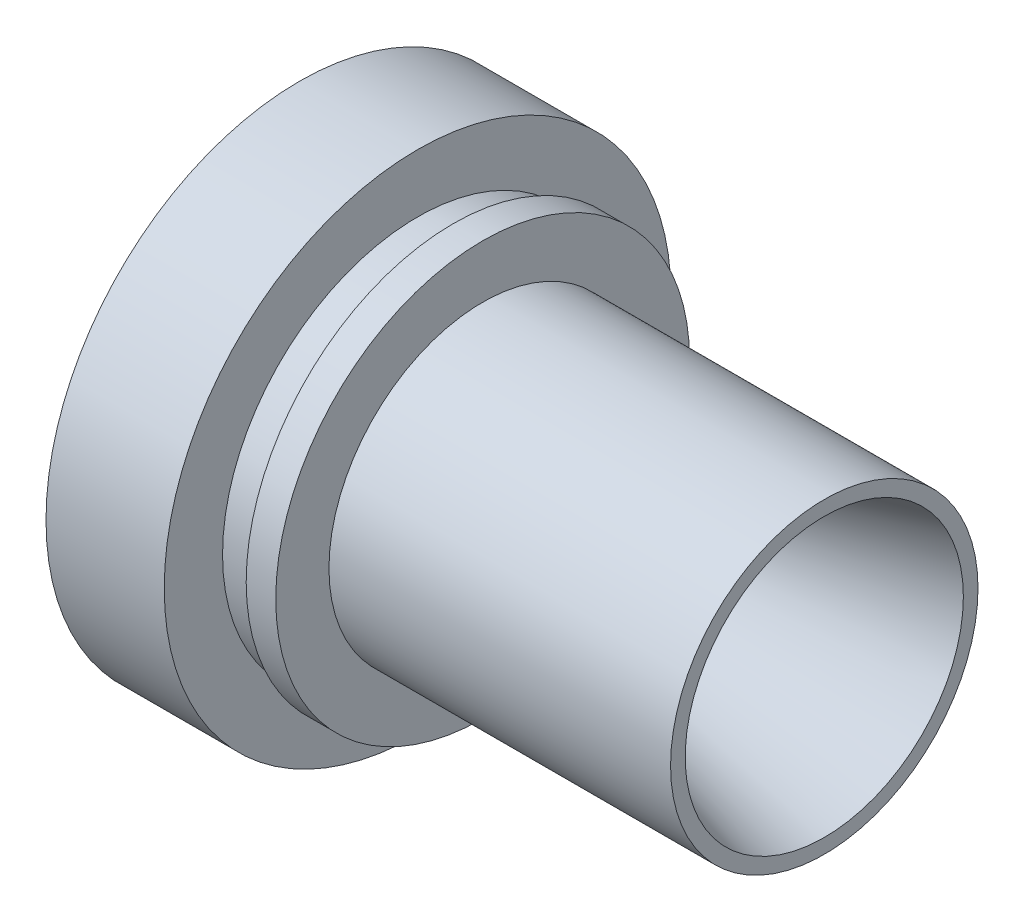
ISO-10303-21;
HEADER;
FILE_DESCRIPTION(('STEP AP214'),'2;1');
FILE_NAME('part.step','',(''),(''),'','','');
FILE_SCHEMA(('AUTOMOTIVE_DESIGN { 1 0 10303 214 1 1 1 1 }'));
ENDSEC;
DATA;
#1=APPLICATION_CONTEXT('core data for automotive mechanical design processes');
#2=APPLICATION_PROTOCOL_DEFINITION('international standard','automotive_design',2000,#1);
#3=PRODUCT_CONTEXT('',#1,'mechanical');
#4=PRODUCT('Part','Part','',(#3));
#5=PRODUCT_RELATED_PRODUCT_CATEGORY('part','',(#4));
#6=PRODUCT_DEFINITION_FORMATION('','',#4);
#7=PRODUCT_DEFINITION_CONTEXT('part definition',#1,'design');
#8=PRODUCT_DEFINITION('design','',#6,#7);
#9=PRODUCT_DEFINITION_SHAPE('','',#8);
#10=(LENGTH_UNIT() NAMED_UNIT(*) SI_UNIT(.MILLI.,.METRE.));
#11=(NAMED_UNIT(*) PLANE_ANGLE_UNIT() SI_UNIT($,.RADIAN.));
#12=(NAMED_UNIT(*) SI_UNIT($,.STERADIAN.) SOLID_ANGLE_UNIT());
#13=UNCERTAINTY_MEASURE_WITH_UNIT(LENGTH_MEASURE(1.E-05),#10,'distance_accuracy_value','');
#14=(GEOMETRIC_REPRESENTATION_CONTEXT(3) GLOBAL_UNCERTAINTY_ASSIGNED_CONTEXT((#13)) GLOBAL_UNIT_ASSIGNED_CONTEXT((#10,
#11,#12)) REPRESENTATION_CONTEXT('',''));
#15=CARTESIAN_POINT('',(0.,0.,0.));
#16=DIRECTION('',(0.,0.,1.));
#17=DIRECTION('',(1.,0.,0.));
#18=AXIS2_PLACEMENT_3D('',#15,#16,#17);
#19=CARTESIAN_POINT('',(18.4932034355967,0.,0.));
#20=DIRECTION('',(1.,0.,0.));
#21=DIRECTION('',(0.,0.,-1.));
#22=AXIS2_PLACEMENT_3D('',#19,#20,#21);
#23=TOROIDAL_SURFACE('',#22,25.58,15.);
#24=CARTESIAN_POINT('',(22.3754891121344,0.,0.));
#25=DIRECTION('',(1.,0.,0.));
#26=DIRECTION('',(0.,0.,-1.));
#27=AXIS2_PLACEMENT_3D('',#24,#25,#26);
#28=CIRCLE('',#27,11.091112605664);
#29=CARTESIAN_POINT('',(22.3754891121344,0.,-11.091112605664));
#30=VERTEX_POINT('',#29);
#31=EDGE_CURVE('E10',#30,#30,#28,.T.);
#32=ORIENTED_EDGE('',*,*,#31,.T.);
#33=EDGE_LOOP('',(#32));
#34=FACE_BOUND('',#33,.T.);
#35=CARTESIAN_POINT('',(7.88660171779858,0.,0.));
#36=DIRECTION('',(1.,0.,0.));
#37=DIRECTION('',(0.,0.,-1.));
#38=AXIS2_PLACEMENT_3D('',#35,#36,#37);
#39=CIRCLE('',#38,14.9733982822017);
#40=CARTESIAN_POINT('',(7.88660171779858,0.,-14.9733982822017));
#41=VERTEX_POINT('',#40);
#42=EDGE_CURVE('E84',#41,#41,#39,.T.);
#43=ORIENTED_EDGE('',*,*,#42,.F.);
#44=EDGE_LOOP('',(#43));
#45=FACE_BOUND('',#44,.T.);
#46=ADVANCED_FACE('F37',(#34,#45),#23,.T.);
#47=CARTESIAN_POINT('',(22.3754891121344,0.,0.));
#48=DIRECTION('',(1.,0.,0.));
#49=DIRECTION('',(0.,0.,-1.));
#50=AXIS2_PLACEMENT_3D('',#47,#48,#49);
#51=CONICAL_SURFACE('',#50,11.091112605664,0.261799387799143);
#52=CARTESIAN_POINT('',(68.779388603388,0.,0.));
#53=DIRECTION('',(1.,0.,0.));
#54=DIRECTION('',(0.,0.,-1.));
#55=AXIS2_PLACEMENT_3D('',#52,#53,#54);
#56=CIRCLE('',#55,23.525);
#57=CARTESIAN_POINT('',(68.779388603388,0.,-23.525));
#58=VERTEX_POINT('',#57);
#59=EDGE_CURVE('E44',#58,#58,#56,.T.);
#60=ORIENTED_EDGE('',*,*,#59,.T.);
#61=EDGE_LOOP('',(#60));
#62=FACE_BOUND('',#61,.T.);
#63=ORIENTED_EDGE('',*,*,#31,.F.);
#64=EDGE_LOOP('',(#63));
#65=FACE_BOUND('',#64,.T.);
#66=ADVANCED_FACE('F93',(#62,#65),#51,.F.);
#67=CARTESIAN_POINT('',(68.779388603388,23.525,0.));
#68=DIRECTION('',(1.,0.,0.));
#69=DIRECTION('',(0.,0.,-1.));
#70=AXIS2_PLACEMENT_3D('',#67,#68,#69);
#71=PLANE('',#70);
#72=CARTESIAN_POINT('',(68.779388603388,0.,0.));
#73=DIRECTION('',(1.,0.,0.));
#74=DIRECTION('',(0.,0.,-1.));
#75=AXIS2_PLACEMENT_3D('',#72,#73,#74);
#76=CIRCLE('',#75,26.);
#77=CARTESIAN_POINT('',(68.779388603388,0.,-26.));
#78=VERTEX_POINT('',#77);
#79=EDGE_CURVE('E49',#78,#78,#76,.T.);
#80=ORIENTED_EDGE('',*,*,#79,.T.);
#81=EDGE_LOOP('',(#80));
#82=FACE_BOUND('',#81,.T.);
#83=ORIENTED_EDGE('',*,*,#59,.F.);
#84=EDGE_LOOP('',(#83));
#85=FACE_BOUND('',#84,.T.);
#86=ADVANCED_FACE('F97',(#82,#85),#71,.T.);
#87=CARTESIAN_POINT('',(0.,0.,0.));
#88=DIRECTION('',(1.,0.,0.));
#89=DIRECTION('',(0.,0.,-1.));
#90=AXIS2_PLACEMENT_3D('',#87,#88,#89);
#91=CYLINDRICAL_SURFACE('',#90,26.);
#92=CARTESIAN_POINT('',(11.,0.,0.));
#93=DIRECTION('',(1.,0.,0.));
#94=DIRECTION('',(0.,0.,-1.));
#95=AXIS2_PLACEMENT_3D('',#92,#93,#94);
#96=CIRCLE('',#95,26.);
#97=CARTESIAN_POINT('',(11.,0.,-26.));
#98=VERTEX_POINT('',#97);
#99=EDGE_CURVE('E54',#98,#98,#96,.T.);
#100=ORIENTED_EDGE('',*,*,#99,.T.);
#101=EDGE_LOOP('',(#100));
#102=FACE_BOUND('',#101,.T.);
#103=ORIENTED_EDGE('',*,*,#79,.F.);
#104=EDGE_LOOP('',(#103));
#105=FACE_BOUND('',#104,.T.);
#106=ADVANCED_FACE('F101',(#102,#105),#91,.T.);
#107=CARTESIAN_POINT('',(11.,26.,0.));
#108=DIRECTION('',(1.,0.,0.));
#109=DIRECTION('',(0.,0.,-1.));
#110=AXIS2_PLACEMENT_3D('',#107,#108,#109);
#111=PLANE('',#110);
#112=CARTESIAN_POINT('',(11.,0.,0.));
#113=DIRECTION('',(1.,0.,0.));
#114=DIRECTION('',(0.,0.,-1.));
#115=AXIS2_PLACEMENT_3D('',#112,#113,#114);
#116=CIRCLE('',#115,35.);
#117=CARTESIAN_POINT('',(11.,0.,-35.));
#118=VERTEX_POINT('',#117);
#119=EDGE_CURVE('E60',#118,#118,#116,.T.);
#120=ORIENTED_EDGE('',*,*,#119,.T.);
#121=EDGE_LOOP('',(#120));
#122=FACE_BOUND('',#121,.T.);
#123=ORIENTED_EDGE('',*,*,#99,.F.);
#124=EDGE_LOOP('',(#123));
#125=FACE_BOUND('',#124,.T.);
#126=ADVANCED_FACE('F108',(#122,#125),#111,.T.);
#127=CARTESIAN_POINT('',(0.,0.,0.));
#128=DIRECTION('',(1.,0.,0.));
#129=DIRECTION('',(0.,0.,-1.));
#130=AXIS2_PLACEMENT_3D('',#127,#128,#129);
#131=CYLINDRICAL_SURFACE('',#130,35.);
#132=CARTESIAN_POINT('',(6.,0.,0.));
#133=DIRECTION('',(1.,0.,0.));
#134=DIRECTION('',(0.,0.,-1.));
#135=AXIS2_PLACEMENT_3D('',#132,#133,#134);
#136=CIRCLE('',#135,35.);
#137=CARTESIAN_POINT('',(6.,0.,-35.));
#138=VERTEX_POINT('',#137);
#139=EDGE_CURVE('E64',#138,#138,#136,.T.);
#140=ORIENTED_EDGE('',*,*,#139,.T.);
#141=EDGE_LOOP('',(#140));
#142=FACE_BOUND('',#141,.T.);
#143=ORIENTED_EDGE('',*,*,#119,.F.);
#144=EDGE_LOOP('',(#143));
#145=FACE_BOUND('',#144,.T.);
#146=ADVANCED_FACE('F112',(#142,#145),#131,.T.);
#147=CARTESIAN_POINT('',(6.,35.,0.));
#148=DIRECTION('',(-1.,0.,0.));
#149=DIRECTION('',(0.,0.,1.));
#150=AXIS2_PLACEMENT_3D('',#147,#148,#149);
#151=PLANE('',#150);
#152=CARTESIAN_POINT('',(6.,0.,0.));
#153=DIRECTION('',(1.,0.,0.));
#154=DIRECTION('',(0.,0.,-1.));
#155=AXIS2_PLACEMENT_3D('',#152,#153,#154);
#156=CIRCLE('',#155,33.);
#157=CARTESIAN_POINT('',(6.,0.,-33.));
#158=VERTEX_POINT('',#157);
#159=EDGE_CURVE('E68',#158,#158,#156,.T.);
#160=ORIENTED_EDGE('',*,*,#159,.T.);
#161=EDGE_LOOP('',(#160));
#162=FACE_BOUND('',#161,.T.);
#163=ORIENTED_EDGE('',*,*,#139,.F.);
#164=EDGE_LOOP('',(#163));
#165=FACE_BOUND('',#164,.T.);
#166=ADVANCED_FACE('F116',(#162,#165),#151,.T.);
#167=CARTESIAN_POINT('',(0.,0.,0.));
#168=DIRECTION('',(1.,0.,0.));
#169=DIRECTION('',(0.,0.,-1.));
#170=AXIS2_PLACEMENT_3D('',#167,#168,#169);
#171=CYLINDRICAL_SURFACE('',#170,33.);
#172=CARTESIAN_POINT('',(0.,0.,0.));
#173=DIRECTION('',(1.,0.,0.));
#174=DIRECTION('',(0.,0.,-1.));
#175=AXIS2_PLACEMENT_3D('',#172,#173,#174);
#176=CIRCLE('',#175,33.);
#177=CARTESIAN_POINT('',(0.,0.,-33.));
#178=VERTEX_POINT('',#177);
#179=EDGE_CURVE('E72',#178,#178,#176,.T.);
#180=ORIENTED_EDGE('',*,*,#179,.T.);
#181=EDGE_LOOP('',(#180));
#182=FACE_BOUND('',#181,.T.);
#183=ORIENTED_EDGE('',*,*,#159,.F.);
#184=EDGE_LOOP('',(#183));
#185=FACE_BOUND('',#184,.T.);
#186=ADVANCED_FACE('F120',(#182,#185),#171,.T.);
#187=CARTESIAN_POINT('',(0.,33.,0.));
#188=DIRECTION('',(1.,0.,0.));
#189=DIRECTION('',(0.,0.,-1.));
#190=AXIS2_PLACEMENT_3D('',#187,#188,#189);
#191=PLANE('',#190);
#192=CARTESIAN_POINT('',(0.,0.,0.));
#193=DIRECTION('',(1.,0.,0.));
#194=DIRECTION('',(0.,0.,-1.));
#195=AXIS2_PLACEMENT_3D('',#192,#193,#194);
#196=CIRCLE('',#195,42.86);
#197=CARTESIAN_POINT('',(0.,0.,-42.86));
#198=VERTEX_POINT('',#197);
#199=EDGE_CURVE('E76',#198,#198,#196,.T.);
#200=ORIENTED_EDGE('',*,*,#199,.T.);
#201=EDGE_LOOP('',(#200));
#202=FACE_BOUND('',#201,.T.);
#203=ORIENTED_EDGE('',*,*,#179,.F.);
#204=EDGE_LOOP('',(#203));
#205=FACE_BOUND('',#204,.T.);
#206=ADVANCED_FACE('F124',(#202,#205),#191,.T.);
#207=CARTESIAN_POINT('',(0.,0.,0.));
#208=DIRECTION('',(1.,0.,0.));
#209=DIRECTION('',(0.,0.,-1.));
#210=AXIS2_PLACEMENT_3D('',#207,#208,#209);
#211=CYLINDRICAL_SURFACE('',#210,42.86);
#212=CARTESIAN_POINT('',(-20.,0.,0.));
#213=DIRECTION('',(1.,0.,0.));
#214=DIRECTION('',(0.,0.,-1.));
#215=AXIS2_PLACEMENT_3D('',#212,#213,#214);
#216=CIRCLE('',#215,42.86);
#217=CARTESIAN_POINT('',(-20.,0.,-42.86));
#218=VERTEX_POINT('',#217);
#219=EDGE_CURVE('E80',#218,#218,#216,.T.);
#220=ORIENTED_EDGE('',*,*,#219,.T.);
#221=EDGE_LOOP('',(#220));
#222=FACE_BOUND('',#221,.T.);
#223=ORIENTED_EDGE('',*,*,#199,.F.);
#224=EDGE_LOOP('',(#223));
#225=FACE_BOUND('',#224,.T.);
#226=ADVANCED_FACE('F128',(#222,#225),#211,.T.);
#227=CARTESIAN_POINT('',(-20.,0.,0.));
#228=DIRECTION('',(-1.,0.,0.));
#229=DIRECTION('',(0.,0.,1.));
#230=AXIS2_PLACEMENT_3D('',#227,#228,#229);
#231=CONICAL_SURFACE('',#230,42.86,0.785398163397443);
#232=ORIENTED_EDGE('',*,*,#42,.T.);
#233=EDGE_LOOP('',(#232));
#234=FACE_BOUND('',#233,.T.);
#235=ORIENTED_EDGE('',*,*,#219,.F.);
#236=EDGE_LOOP('',(#235));
#237=FACE_BOUND('',#236,.T.);
#238=ADVANCED_FACE('F89',(#234,#237),#231,.F.);
#239=CLOSED_SHELL('',(#46,#66,#86,#106,#126,#146,#166,#186,#206,#226,#238));
#240=MANIFOLD_SOLID_BREP('B2',#239);
#241=ADVANCED_BREP_SHAPE_REPRESENTATION('',(#18,#240),#14);
#242=SHAPE_DEFINITION_REPRESENTATION(#9,#241);
ENDSEC;
END-ISO-10303-21;
